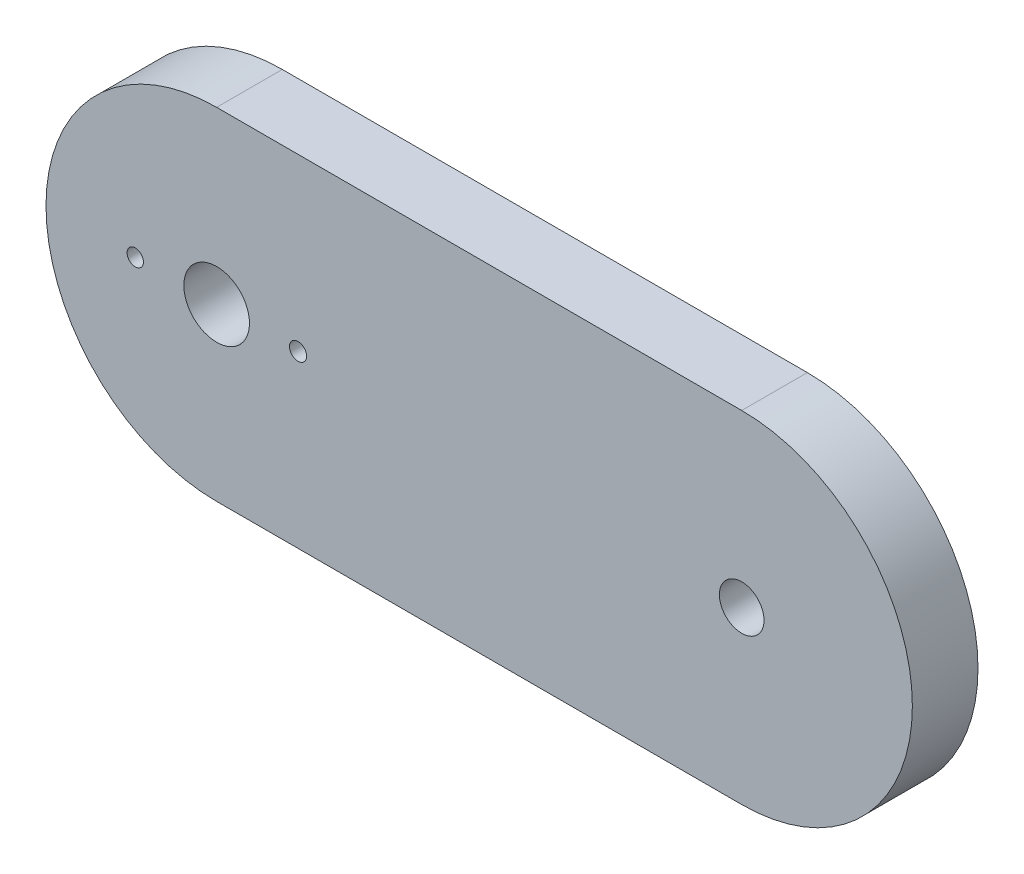
ISO-10303-21;
HEADER;
FILE_DESCRIPTION(('STEP AP214'),'2;1');
FILE_NAME('part.step','',(''),(''),'','','');
FILE_SCHEMA(('AUTOMOTIVE_DESIGN { 1 0 10303 214 1 1 1 1 }'));
ENDSEC;
DATA;
#1=APPLICATION_CONTEXT('core data for automotive mechanical design processes');
#2=APPLICATION_PROTOCOL_DEFINITION('international standard','automotive_design',2000,#1);
#3=PRODUCT_CONTEXT('',#1,'mechanical');
#4=PRODUCT('Part','Part','',(#3));
#5=PRODUCT_RELATED_PRODUCT_CATEGORY('part','',(#4));
#6=PRODUCT_DEFINITION_FORMATION('','',#4);
#7=PRODUCT_DEFINITION_CONTEXT('part definition',#1,'design');
#8=PRODUCT_DEFINITION('design','',#6,#7);
#9=PRODUCT_DEFINITION_SHAPE('','',#8);
#10=(LENGTH_UNIT() NAMED_UNIT(*) SI_UNIT(.MILLI.,.METRE.));
#11=(NAMED_UNIT(*) PLANE_ANGLE_UNIT() SI_UNIT($,.RADIAN.));
#12=(NAMED_UNIT(*) SI_UNIT($,.STERADIAN.) SOLID_ANGLE_UNIT());
#13=UNCERTAINTY_MEASURE_WITH_UNIT(LENGTH_MEASURE(1.E-05),#10,'distance_accuracy_value','');
#14=(GEOMETRIC_REPRESENTATION_CONTEXT(3) GLOBAL_UNCERTAINTY_ASSIGNED_CONTEXT((#13)) GLOBAL_UNIT_ASSIGNED_CONTEXT((#10,
#11,#12)) REPRESENTATION_CONTEXT('',''));
#15=CARTESIAN_POINT('',(0.,0.,0.));
#16=DIRECTION('',(0.,0.,1.));
#17=DIRECTION('',(1.,0.,0.));
#18=AXIS2_PLACEMENT_3D('',#15,#16,#17);
#19=CARTESIAN_POINT('',(0.,-16.51,6.35));
#20=DIRECTION('',(0.,1.,0.));
#21=DIRECTION('',(0.,0.,1.));
#22=AXIS2_PLACEMENT_3D('',#19,#20,#21);
#23=PLANE('',#22);
#24=DIRECTION('',(1.,0.,0.));
#25=VECTOR('',#24,1.);
#26=CARTESIAN_POINT('',(0.,-16.51,0.));
#27=LINE('',#26,#25);
#28=CARTESIAN_POINT('',(-25.4,-16.51,0.));
#29=VERTEX_POINT('',#28);
#30=CARTESIAN_POINT('',(25.4,-16.51,0.));
#31=VERTEX_POINT('',#30);
#32=EDGE_CURVE('E118',#29,#31,#27,.T.);
#33=ORIENTED_EDGE('',*,*,#32,.T.);
#34=DIRECTION('',(0.,0.,-1.));
#35=VECTOR('',#34,1.);
#36=CARTESIAN_POINT('',(25.4,-16.51,6.35));
#37=LINE('',#36,#35);
#38=CARTESIAN_POINT('',(25.4,-16.51,6.35));
#39=VERTEX_POINT('',#38);
#40=EDGE_CURVE('E11',#39,#31,#37,.T.);
#41=ORIENTED_EDGE('',*,*,#40,.F.);
#42=DIRECTION('',(1.,0.,0.));
#43=VECTOR('',#42,1.);
#44=CARTESIAN_POINT('',(0.,-16.51,6.35));
#45=LINE('',#44,#43);
#46=CARTESIAN_POINT('',(-25.4,-16.51,6.35));
#47=VERTEX_POINT('',#46);
#48=EDGE_CURVE('E92',#47,#39,#45,.T.);
#49=ORIENTED_EDGE('',*,*,#48,.F.);
#50=DIRECTION('',(0.,0.,-1.));
#51=VECTOR('',#50,1.);
#52=CARTESIAN_POINT('',(-25.4,-16.51,6.35));
#53=LINE('',#52,#51);
#54=EDGE_CURVE('E58',#47,#29,#53,.T.);
#55=ORIENTED_EDGE('',*,*,#54,.T.);
#56=EDGE_LOOP('',(#33,#41,#49,#55));
#57=FACE_BOUND('',#56,.T.);
#58=ADVANCED_FACE('F41',(#57),#23,.F.);
#59=CARTESIAN_POINT('',(25.4,0.,6.35));
#60=DIRECTION('',(0.,0.,-1.));
#61=DIRECTION('',(-1.,0.,0.));
#62=AXIS2_PLACEMENT_3D('',#59,#60,#61);
#63=CYLINDRICAL_SURFACE('',#62,16.51);
#64=CARTESIAN_POINT('',(25.4,0.,0.));
#65=DIRECTION('',(0.,0.,1.));
#66=DIRECTION('',(1.,0.,0.));
#67=AXIS2_PLACEMENT_3D('',#64,#65,#66);
#68=CIRCLE('',#67,16.51);
#69=CARTESIAN_POINT('',(25.4,16.51,0.));
#70=VERTEX_POINT('',#69);
#71=EDGE_CURVE('E98',#31,#70,#68,.T.);
#72=ORIENTED_EDGE('',*,*,#71,.T.);
#73=DIRECTION('',(0.,0.,-1.));
#74=VECTOR('',#73,1.);
#75=CARTESIAN_POINT('',(25.4,16.51,6.35));
#76=LINE('',#75,#74);
#77=CARTESIAN_POINT('',(25.4,16.51,6.35));
#78=VERTEX_POINT('',#77);
#79=EDGE_CURVE('E50',#78,#70,#76,.T.);
#80=ORIENTED_EDGE('',*,*,#79,.F.);
#81=CARTESIAN_POINT('',(25.4,0.,6.35));
#82=DIRECTION('',(0.,0.,1.));
#83=DIRECTION('',(1.,0.,0.));
#84=AXIS2_PLACEMENT_3D('',#81,#82,#83);
#85=CIRCLE('',#84,16.51);
#86=EDGE_CURVE('E83',#39,#78,#85,.T.);
#87=ORIENTED_EDGE('',*,*,#86,.F.);
#88=ORIENTED_EDGE('',*,*,#40,.T.);
#89=EDGE_LOOP('',(#72,#80,#87,#88));
#90=FACE_BOUND('',#89,.T.);
#91=ADVANCED_FACE('F97',(#90),#63,.T.);
#92=CARTESIAN_POINT('',(0.,16.51,6.35));
#93=DIRECTION('',(0.,1.,0.));
#94=DIRECTION('',(0.,0.,1.));
#95=AXIS2_PLACEMENT_3D('',#92,#93,#94);
#96=PLANE('',#95);
#97=DIRECTION('',(1.,0.,0.));
#98=VECTOR('',#97,1.);
#99=CARTESIAN_POINT('',(0.,16.51,0.));
#100=LINE('',#99,#98);
#101=CARTESIAN_POINT('',(-25.4,16.51,0.));
#102=VERTEX_POINT('',#101);
#103=EDGE_CURVE('E124',#102,#70,#100,.T.);
#104=ORIENTED_EDGE('',*,*,#103,.F.);
#105=DIRECTION('',(0.,0.,-1.));
#106=VECTOR('',#105,1.);
#107=CARTESIAN_POINT('',(-25.4,16.51,6.35));
#108=LINE('',#107,#106);
#109=CARTESIAN_POINT('',(-25.4,16.51,6.35));
#110=VERTEX_POINT('',#109);
#111=EDGE_CURVE('E72',#110,#102,#108,.T.);
#112=ORIENTED_EDGE('',*,*,#111,.F.);
#113=DIRECTION('',(1.,0.,0.));
#114=VECTOR('',#113,1.);
#115=CARTESIAN_POINT('',(0.,16.51,6.35));
#116=LINE('',#115,#114);
#117=EDGE_CURVE('E91',#110,#78,#116,.T.);
#118=ORIENTED_EDGE('',*,*,#117,.T.);
#119=ORIENTED_EDGE('',*,*,#79,.T.);
#120=EDGE_LOOP('',(#104,#112,#118,#119));
#121=FACE_BOUND('',#120,.T.);
#122=ADVANCED_FACE('F102',(#121),#96,.T.);
#123=CARTESIAN_POINT('',(-25.4,0.,6.35));
#124=DIRECTION('',(0.,0.,-1.));
#125=DIRECTION('',(-1.,0.,0.));
#126=AXIS2_PLACEMENT_3D('',#123,#124,#125);
#127=CYLINDRICAL_SURFACE('',#126,3.175);
#128=CARTESIAN_POINT('',(-25.4,0.,6.35));
#129=DIRECTION('',(0.,0.,1.));
#130=DIRECTION('',(1.,0.,0.));
#131=AXIS2_PLACEMENT_3D('',#128,#129,#130);
#132=CIRCLE('',#131,3.175);
#133=CARTESIAN_POINT('',(-22.225,0.,6.35));
#134=VERTEX_POINT('',#133);
#135=EDGE_CURVE('E107',#134,#134,#132,.T.);
#136=ORIENTED_EDGE('',*,*,#135,.T.);
#137=EDGE_LOOP('',(#136));
#138=FACE_BOUND('',#137,.T.);
#139=CARTESIAN_POINT('',(-25.4,0.,0.));
#140=DIRECTION('',(0.,0.,1.));
#141=DIRECTION('',(1.,0.,0.));
#142=AXIS2_PLACEMENT_3D('',#139,#140,#141);
#143=CIRCLE('',#142,3.175);
#144=CARTESIAN_POINT('',(-22.225,0.,0.));
#145=VERTEX_POINT('',#144);
#146=EDGE_CURVE('E131',#145,#145,#143,.T.);
#147=ORIENTED_EDGE('',*,*,#146,.F.);
#148=EDGE_LOOP('',(#147));
#149=FACE_BOUND('',#148,.T.);
#150=ADVANCED_FACE('F174',(#138,#149),#127,.F.);
#151=CARTESIAN_POINT('',(-25.4,0.,6.35));
#152=DIRECTION('',(0.,0.,-1.));
#153=DIRECTION('',(-1.,0.,0.));
#154=AXIS2_PLACEMENT_3D('',#151,#152,#153);
#155=CYLINDRICAL_SURFACE('',#154,16.51);
#156=CARTESIAN_POINT('',(-25.4,0.,0.));
#157=DIRECTION('',(0.,0.,1.));
#158=DIRECTION('',(1.,0.,0.));
#159=AXIS2_PLACEMENT_3D('',#156,#157,#158);
#160=CIRCLE('',#159,16.51);
#161=EDGE_CURVE('E127',#29,#102,#160,.F.);
#162=ORIENTED_EDGE('',*,*,#161,.F.);
#163=ORIENTED_EDGE('',*,*,#54,.F.);
#164=CARTESIAN_POINT('',(-25.4,0.,6.35));
#165=DIRECTION('',(0.,0.,1.));
#166=DIRECTION('',(1.,0.,0.));
#167=AXIS2_PLACEMENT_3D('',#164,#165,#166);
#168=CIRCLE('',#167,16.51);
#169=EDGE_CURVE('E104',#47,#110,#168,.F.);
#170=ORIENTED_EDGE('',*,*,#169,.T.);
#171=ORIENTED_EDGE('',*,*,#111,.T.);
#172=EDGE_LOOP('',(#162,#163,#170,#171));
#173=FACE_BOUND('',#172,.T.);
#174=ADVANCED_FACE('F176',(#173),#155,.T.);
#175=CARTESIAN_POINT('',(25.4,0.,6.35));
#176=DIRECTION('',(0.,0.,-1.));
#177=DIRECTION('',(-1.,0.,0.));
#178=AXIS2_PLACEMENT_3D('',#175,#176,#177);
#179=CYLINDRICAL_SURFACE('',#178,2.159);
#180=CARTESIAN_POINT('',(25.4,0.,6.35));
#181=DIRECTION('',(0.,0.,1.));
#182=DIRECTION('',(1.,0.,0.));
#183=AXIS2_PLACEMENT_3D('',#180,#181,#182);
#184=CIRCLE('',#183,2.159);
#185=CARTESIAN_POINT('',(27.559,0.,6.35));
#186=VERTEX_POINT('',#185);
#187=EDGE_CURVE('E114',#186,#186,#184,.T.);
#188=ORIENTED_EDGE('',*,*,#187,.T.);
#189=EDGE_LOOP('',(#188));
#190=FACE_BOUND('',#189,.T.);
#191=CARTESIAN_POINT('',(25.4,0.,0.));
#192=DIRECTION('',(0.,0.,1.));
#193=DIRECTION('',(1.,0.,0.));
#194=AXIS2_PLACEMENT_3D('',#191,#192,#193);
#195=CIRCLE('',#194,2.159);
#196=CARTESIAN_POINT('',(27.559,0.,0.));
#197=VERTEX_POINT('',#196);
#198=EDGE_CURVE('E135',#197,#197,#195,.T.);
#199=ORIENTED_EDGE('',*,*,#198,.F.);
#200=EDGE_LOOP('',(#199));
#201=FACE_BOUND('',#200,.T.);
#202=ADVANCED_FACE('F183',(#190,#201),#179,.F.);
#203=CARTESIAN_POINT('',(0.,0.,6.35));
#204=DIRECTION('',(0.,0.,1.));
#205=DIRECTION('',(1.,0.,0.));
#206=AXIS2_PLACEMENT_3D('',#203,#204,#205);
#207=PLANE('',#206);
#208=CARTESIAN_POINT('',(-17.526,0.,6.35));
#209=DIRECTION('',(0.,0.,1.));
#210=DIRECTION('',(1.,0.,0.));
#211=AXIS2_PLACEMENT_3D('',#208,#209,#210);
#212=CIRCLE('',#211,0.829532787932635);
#213=CARTESIAN_POINT('',(-16.6964672120674,0.,6.35));
#214=VERTEX_POINT('',#213);
#215=EDGE_CURVE('E121',#214,#214,#212,.T.);
#216=ORIENTED_EDGE('',*,*,#215,.F.);
#217=EDGE_LOOP('',(#216));
#218=FACE_BOUND('',#217,.T.);
#219=CARTESIAN_POINT('',(-33.274,0.,6.35));
#220=DIRECTION('',(0.,0.,1.));
#221=DIRECTION('',(1.,0.,0.));
#222=AXIS2_PLACEMENT_3D('',#219,#220,#221);
#223=CIRCLE('',#222,0.792789717671778);
#224=CARTESIAN_POINT('',(-32.4812102823282,0.,6.35));
#225=VERTEX_POINT('',#224);
#226=EDGE_CURVE('E149',#225,#225,#223,.T.);
#227=ORIENTED_EDGE('',*,*,#226,.F.);
#228=EDGE_LOOP('',(#227));
#229=FACE_BOUND('',#228,.T.);
#230=ORIENTED_EDGE('',*,*,#48,.T.);
#231=ORIENTED_EDGE('',*,*,#86,.T.);
#232=ORIENTED_EDGE('',*,*,#117,.F.);
#233=ORIENTED_EDGE('',*,*,#169,.F.);
#234=EDGE_LOOP('',(#230,#231,#232,#233));
#235=FACE_BOUND('',#234,.T.);
#236=ORIENTED_EDGE('',*,*,#135,.F.);
#237=EDGE_LOOP('',(#236));
#238=FACE_BOUND('',#237,.T.);
#239=ORIENTED_EDGE('',*,*,#187,.F.);
#240=EDGE_LOOP('',(#239));
#241=FACE_BOUND('',#240,.T.);
#242=ADVANCED_FACE('F87',(#218,#229,#235,#238,#241),#207,.T.);
#243=CARTESIAN_POINT('',(0.,0.,0.));
#244=DIRECTION('',(0.,0.,1.));
#245=DIRECTION('',(1.,0.,0.));
#246=AXIS2_PLACEMENT_3D('',#243,#244,#245);
#247=PLANE('',#246);
#248=CARTESIAN_POINT('',(-17.526,0.,0.));
#249=DIRECTION('',(0.,0.,-1.));
#250=DIRECTION('',(-1.,0.,0.));
#251=AXIS2_PLACEMENT_3D('',#248,#249,#250);
#252=CIRCLE('',#251,0.829532787932635);
#253=CARTESIAN_POINT('',(-18.3555327879326,0.,0.));
#254=VERTEX_POINT('',#253);
#255=EDGE_CURVE('E153',#254,#254,#252,.T.);
#256=ORIENTED_EDGE('',*,*,#255,.F.);
#257=EDGE_LOOP('',(#256));
#258=FACE_BOUND('',#257,.T.);
#259=CARTESIAN_POINT('',(-33.274,0.,0.));
#260=DIRECTION('',(0.,0.,-1.));
#261=DIRECTION('',(-1.,0.,0.));
#262=AXIS2_PLACEMENT_3D('',#259,#260,#261);
#263=CIRCLE('',#262,0.792789717671778);
#264=CARTESIAN_POINT('',(-34.0667897176718,0.,0.));
#265=VERTEX_POINT('',#264);
#266=EDGE_CURVE('E154',#265,#265,#263,.T.);
#267=ORIENTED_EDGE('',*,*,#266,.F.);
#268=EDGE_LOOP('',(#267));
#269=FACE_BOUND('',#268,.T.);
#270=ORIENTED_EDGE('',*,*,#32,.F.);
#271=ORIENTED_EDGE('',*,*,#161,.T.);
#272=ORIENTED_EDGE('',*,*,#103,.T.);
#273=ORIENTED_EDGE('',*,*,#71,.F.);
#274=EDGE_LOOP('',(#270,#271,#272,#273));
#275=FACE_BOUND('',#274,.T.);
#276=ORIENTED_EDGE('',*,*,#146,.T.);
#277=EDGE_LOOP('',(#276));
#278=FACE_BOUND('',#277,.T.);
#279=ORIENTED_EDGE('',*,*,#198,.T.);
#280=EDGE_LOOP('',(#279));
#281=FACE_BOUND('',#280,.T.);
#282=ADVANCED_FACE('F164',(#258,#269,#275,#278,#281),#247,.F.);
#283=CARTESIAN_POINT('',(-33.274,0.,17.272));
#284=DIRECTION('',(0.,0.,-1.));
#285=DIRECTION('',(-1.,0.,0.));
#286=AXIS2_PLACEMENT_3D('',#283,#284,#285);
#287=CYLINDRICAL_SURFACE('',#286,0.792789717671778);
#288=ORIENTED_EDGE('',*,*,#226,.T.);
#289=EDGE_LOOP('',(#288));
#290=FACE_BOUND('',#289,.T.);
#291=ORIENTED_EDGE('',*,*,#266,.T.);
#292=EDGE_LOOP('',(#291));
#293=FACE_BOUND('',#292,.T.);
#294=ADVANCED_FACE('F167',(#290,#293),#287,.F.);
#295=CARTESIAN_POINT('',(-17.526,0.,17.272));
#296=DIRECTION('',(0.,0.,-1.));
#297=DIRECTION('',(-1.,0.,0.));
#298=AXIS2_PLACEMENT_3D('',#295,#296,#297);
#299=CYLINDRICAL_SURFACE('',#298,0.829532787932635);
#300=ORIENTED_EDGE('',*,*,#215,.T.);
#301=EDGE_LOOP('',(#300));
#302=FACE_BOUND('',#301,.T.);
#303=ORIENTED_EDGE('',*,*,#255,.T.);
#304=EDGE_LOOP('',(#303));
#305=FACE_BOUND('',#304,.T.);
#306=ADVANCED_FACE('F162',(#302,#305),#299,.F.);
#307=CLOSED_SHELL('',(#58,#91,#122,#150,#174,#202,#242,#282,#294,#306));
#308=MANIFOLD_SOLID_BREP('B2',#307);
#309=ADVANCED_BREP_SHAPE_REPRESENTATION('',(#18,#308),#14);
#310=SHAPE_DEFINITION_REPRESENTATION(#9,#309);
ENDSEC;
END-ISO-10303-21;
